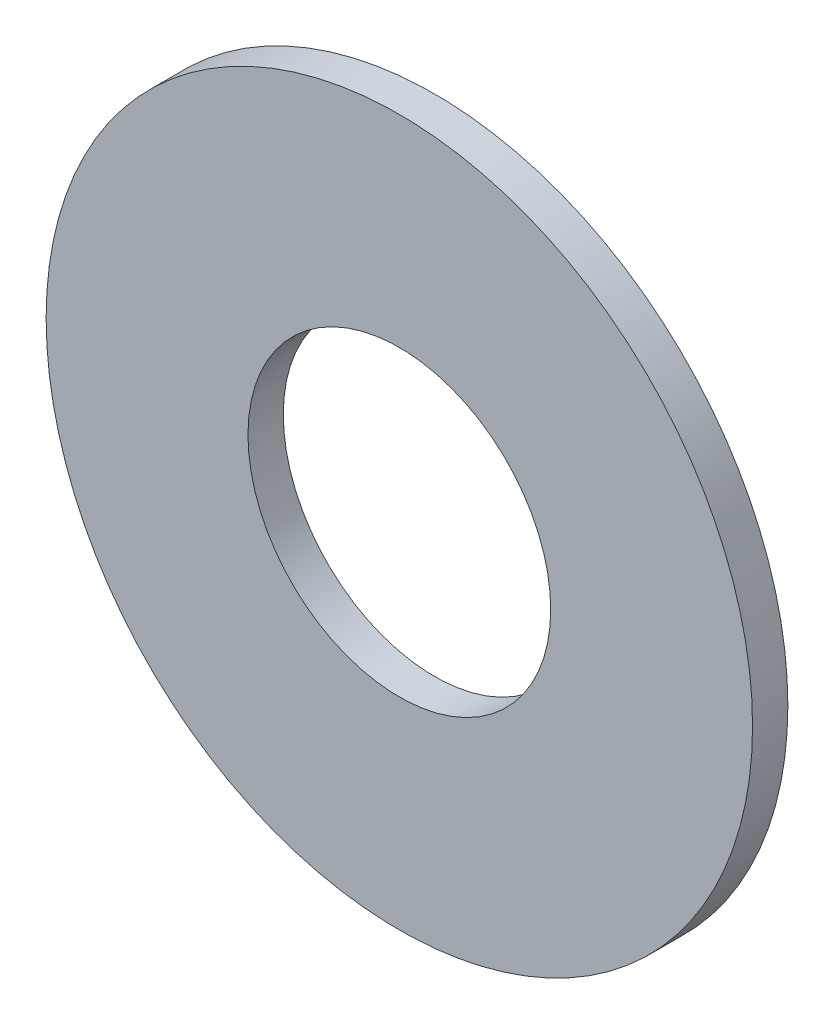
ISO-10303-21;
HEADER;
FILE_DESCRIPTION(('STEP AP214'),'2;1');
FILE_NAME('part.step','',(''),(''),'','','');
FILE_SCHEMA(('AUTOMOTIVE_DESIGN { 1 0 10303 214 1 1 1 1 }'));
ENDSEC;
DATA;
#1=APPLICATION_CONTEXT('core data for automotive mechanical design processes');
#2=APPLICATION_PROTOCOL_DEFINITION('international standard','automotive_design',2000,#1);
#3=PRODUCT_CONTEXT('',#1,'mechanical');
#4=PRODUCT('Part','Part','',(#3));
#5=PRODUCT_RELATED_PRODUCT_CATEGORY('part','',(#4));
#6=PRODUCT_DEFINITION_FORMATION('','',#4);
#7=PRODUCT_DEFINITION_CONTEXT('part definition',#1,'design');
#8=PRODUCT_DEFINITION('design','',#6,#7);
#9=PRODUCT_DEFINITION_SHAPE('','',#8);
#10=(LENGTH_UNIT() NAMED_UNIT(*) SI_UNIT(.MILLI.,.METRE.));
#11=(NAMED_UNIT(*) PLANE_ANGLE_UNIT() SI_UNIT($,.RADIAN.));
#12=(NAMED_UNIT(*) SI_UNIT($,.STERADIAN.) SOLID_ANGLE_UNIT());
#13=UNCERTAINTY_MEASURE_WITH_UNIT(LENGTH_MEASURE(1.E-05),#10,'distance_accuracy_value','');
#14=(GEOMETRIC_REPRESENTATION_CONTEXT(3) GLOBAL_UNCERTAINTY_ASSIGNED_CONTEXT((#13)) GLOBAL_UNIT_ASSIGNED_CONTEXT((#10,
#11,#12)) REPRESENTATION_CONTEXT('',''));
#15=CARTESIAN_POINT('',(0.,0.,0.));
#16=DIRECTION('',(0.,0.,1.));
#17=DIRECTION('',(1.,0.,0.));
#18=AXIS2_PLACEMENT_3D('',#15,#16,#17);
#19=CARTESIAN_POINT('',(0.,0.,0.7));
#20=DIRECTION('',(0.,0.,-1.));
#21=DIRECTION('',(-1.,0.,0.));
#22=AXIS2_PLACEMENT_3D('',#19,#20,#21);
#23=CYLINDRICAL_SURFACE('',#22,7.);
#24=CARTESIAN_POINT('',(0.,0.,0.7));
#25=DIRECTION('',(0.,0.,1.));
#26=DIRECTION('',(1.,0.,0.));
#27=AXIS2_PLACEMENT_3D('',#24,#25,#26);
#28=CIRCLE('',#27,7.);
#29=CARTESIAN_POINT('',(7.,0.,0.7));
#30=VERTEX_POINT('',#29);
#31=EDGE_CURVE('E10',#30,#30,#28,.T.);
#32=ORIENTED_EDGE('',*,*,#31,.F.);
#33=EDGE_LOOP('',(#32));
#34=FACE_BOUND('',#33,.T.);
#35=CARTESIAN_POINT('',(0.,0.,0.));
#36=DIRECTION('',(0.,0.,1.));
#37=DIRECTION('',(1.,0.,0.));
#38=AXIS2_PLACEMENT_3D('',#35,#36,#37);
#39=CIRCLE('',#38,7.);
#40=CARTESIAN_POINT('',(7.,0.,0.));
#41=VERTEX_POINT('',#40);
#42=EDGE_CURVE('E39',#41,#41,#39,.T.);
#43=ORIENTED_EDGE('',*,*,#42,.T.);
#44=EDGE_LOOP('',(#43));
#45=FACE_BOUND('',#44,.T.);
#46=ADVANCED_FACE('F32',(#34,#45),#23,.T.);
#47=CARTESIAN_POINT('',(0.,0.,0.7));
#48=DIRECTION('',(0.,0.,1.));
#49=DIRECTION('',(1.,0.,0.));
#50=AXIS2_PLACEMENT_3D('',#47,#48,#49);
#51=PLANE('',#50);
#52=CARTESIAN_POINT('',(0.,0.,0.7));
#53=DIRECTION('',(0.,0.,1.));
#54=DIRECTION('',(1.,0.,0.));
#55=AXIS2_PLACEMENT_3D('',#52,#53,#54);
#56=CIRCLE('',#55,3.);
#57=CARTESIAN_POINT('',(3.,0.,0.7));
#58=VERTEX_POINT('',#57);
#59=EDGE_CURVE('E45',#58,#58,#56,.T.);
#60=ORIENTED_EDGE('',*,*,#59,.F.);
#61=EDGE_LOOP('',(#60));
#62=FACE_BOUND('',#61,.T.);
#63=ORIENTED_EDGE('',*,*,#31,.T.);
#64=EDGE_LOOP('',(#63));
#65=FACE_BOUND('',#64,.T.);
#66=ADVANCED_FACE('F61',(#62,#65),#51,.T.);
#67=CARTESIAN_POINT('',(0.,0.,0.));
#68=DIRECTION('',(0.,0.,1.));
#69=DIRECTION('',(1.,0.,0.));
#70=AXIS2_PLACEMENT_3D('',#67,#68,#69);
#71=PLANE('',#70);
#72=CARTESIAN_POINT('',(0.,0.,0.));
#73=DIRECTION('',(0.,0.,1.));
#74=DIRECTION('',(1.,0.,0.));
#75=AXIS2_PLACEMENT_3D('',#72,#73,#74);
#76=CIRCLE('',#75,3.);
#77=CARTESIAN_POINT('',(3.,0.,0.));
#78=VERTEX_POINT('',#77);
#79=EDGE_CURVE('E35',#78,#78,#76,.T.);
#80=ORIENTED_EDGE('',*,*,#79,.T.);
#81=EDGE_LOOP('',(#80));
#82=FACE_BOUND('',#81,.T.);
#83=ORIENTED_EDGE('',*,*,#42,.F.);
#84=EDGE_LOOP('',(#83));
#85=FACE_BOUND('',#84,.T.);
#86=ADVANCED_FACE('F52',(#82,#85),#71,.F.);
#87=CARTESIAN_POINT('',(0.,0.,-0.8));
#88=DIRECTION('',(0.,0.,1.));
#89=DIRECTION('',(1.,0.,0.));
#90=AXIS2_PLACEMENT_3D('',#87,#88,#89);
#91=CYLINDRICAL_SURFACE('',#90,3.);
#92=ORIENTED_EDGE('',*,*,#59,.T.);
#93=EDGE_LOOP('',(#92));
#94=FACE_BOUND('',#93,.T.);
#95=ORIENTED_EDGE('',*,*,#79,.F.);
#96=EDGE_LOOP('',(#95));
#97=FACE_BOUND('',#96,.T.);
#98=ADVANCED_FACE('F55',(#94,#97),#91,.F.);
#99=CLOSED_SHELL('',(#46,#66,#86,#98));
#100=MANIFOLD_SOLID_BREP('B2',#99);
#101=ADVANCED_BREP_SHAPE_REPRESENTATION('',(#18,#100),#14);
#102=SHAPE_DEFINITION_REPRESENTATION(#9,#101);
ENDSEC;
END-ISO-10303-21;
